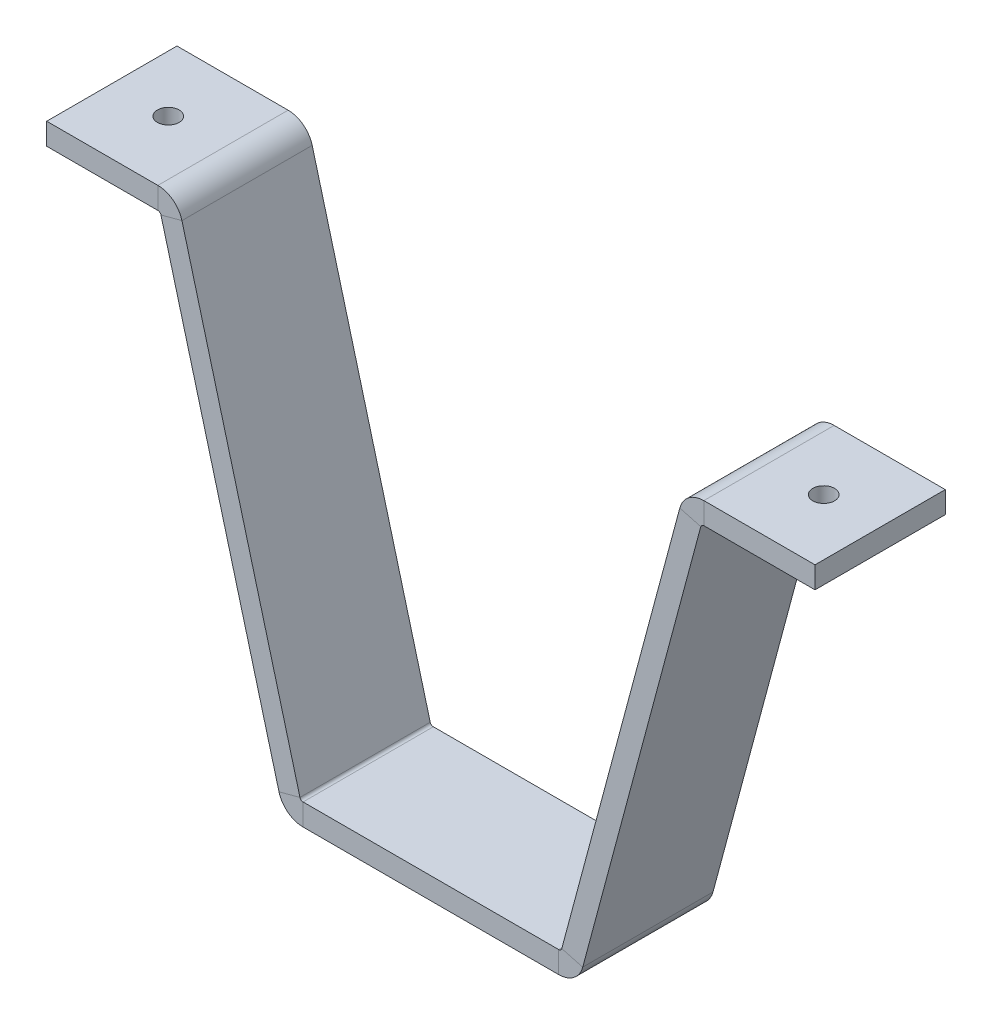
ISO-10303-21;
HEADER;
FILE_DESCRIPTION(('STEP AP214'),'2;1');
FILE_NAME('part.step','',(''),(''),'','','');
FILE_SCHEMA(('AUTOMOTIVE_DESIGN { 1 0 10303 214 1 1 1 1 }'));
ENDSEC;
DATA;
#1=APPLICATION_CONTEXT('core data for automotive mechanical design processes');
#2=APPLICATION_PROTOCOL_DEFINITION('international standard','automotive_design',2000,#1);
#3=PRODUCT_CONTEXT('',#1,'mechanical');
#4=PRODUCT('Part','Part','',(#3));
#5=PRODUCT_RELATED_PRODUCT_CATEGORY('part','',(#4));
#6=PRODUCT_DEFINITION_FORMATION('','',#4);
#7=PRODUCT_DEFINITION_CONTEXT('part definition',#1,'design');
#8=PRODUCT_DEFINITION('design','',#6,#7);
#9=PRODUCT_DEFINITION_SHAPE('','',#8);
#10=(LENGTH_UNIT() NAMED_UNIT(*) SI_UNIT(.MILLI.,.METRE.));
#11=(NAMED_UNIT(*) PLANE_ANGLE_UNIT() SI_UNIT($,.RADIAN.));
#12=(NAMED_UNIT(*) SI_UNIT($,.STERADIAN.) SOLID_ANGLE_UNIT());
#13=UNCERTAINTY_MEASURE_WITH_UNIT(LENGTH_MEASURE(1.E-05),#10,'distance_accuracy_value','');
#14=(GEOMETRIC_REPRESENTATION_CONTEXT(3) GLOBAL_UNCERTAINTY_ASSIGNED_CONTEXT((#13)) GLOBAL_UNIT_ASSIGNED_CONTEXT((#10,
#11,#12)) REPRESENTATION_CONTEXT('',''));
#15=CARTESIAN_POINT('',(0.,0.,0.));
#16=DIRECTION('',(0.,0.,1.));
#17=DIRECTION('',(1.,0.,0.));
#18=AXIS2_PLACEMENT_3D('',#15,#16,#17);
#19=CARTESIAN_POINT('',(62.3067299011725,106.251840891797,4.99999999999998));
#20=DIRECTION('',(0.,0.,1.));
#21=DIRECTION('',(1.,0.,0.));
#22=AXIS2_PLACEMENT_3D('',#19,#20,#21);
#23=PLANE('',#22);
#24=DIRECTION('',(0.258819045102525,0.965925826289067,0.));
#25=VECTOR('',#24,1.);
#26=CARTESIAN_POINT('',(62.3067299011725,106.251840891797,4.99999999999998));
#27=LINE('',#26,#25);
#28=CARTESIAN_POINT('',(34.9759170357446,4.25185866586486,5.));
#29=VERTEX_POINT('',#28);
#30=CARTESIAN_POINT('',(62.1604419968733,105.70588700042,4.99999999999998));
#31=VERTEX_POINT('',#30);
#32=EDGE_CURVE('E346',#29,#31,#27,.T.);
#33=ORIENTED_EDGE('',*,*,#32,.T.);
#34=DIRECTION('',(-0.965925826289065,0.258819045102533,0.));
#35=VECTOR('',#34,1.);
#36=CARTESIAN_POINT('',(62.1604419968733,105.70588700042,4.99999999999999));
#37=LINE('',#36,#35);
#38=CARTESIAN_POINT('',(57.3308128654279,106.999982225933,4.99999999999999));
#39=VERTEX_POINT('',#38);
#40=EDGE_CURVE('E227',#31,#39,#37,.T.);
#41=ORIENTED_EDGE('',*,*,#40,.T.);
#42=DIRECTION('',(0.258819045102525,0.965925826289067,0.));
#43=VECTOR('',#42,1.);
#44=CARTESIAN_POINT('',(57.4771007697272,107.54593611731,4.99999999999998));
#45=LINE('',#44,#43);
#46=CARTESIAN_POINT('',(30.1462879042992,5.54595389137748,5.));
#47=VERTEX_POINT('',#46);
#48=EDGE_CURVE('E345',#47,#39,#45,.T.);
#49=ORIENTED_EDGE('',*,*,#48,.F.);
#50=DIRECTION('',(0.965925826289067,-0.258819045102525,0.));
#51=VECTOR('',#50,1.);
#52=CARTESIAN_POINT('',(30.1462879042992,5.54595389137748,4.99999999999999));
#53=LINE('',#52,#51);
#54=EDGE_CURVE('E332',#47,#29,#53,.T.);
#55=ORIENTED_EDGE('',*,*,#54,.T.);
#56=EDGE_LOOP('',(#33,#41,#49,#55));
#57=FACE_BOUND('',#56,.T.);
#58=ADVANCED_FACE('F33',(#57),#23,.T.);
#59=CARTESIAN_POINT('',(34.8296291314453,3.70590477448738,-25.));
#60=DIRECTION('',(0.965925826289067,-0.258819045102525,0.));
#61=DIRECTION('',(0.258819045102525,0.965925826289067,0.));
#62=AXIS2_PLACEMENT_3D('',#59,#60,#61);
#63=PLANE('',#62);
#64=DIRECTION('',(-0.258819045102525,-0.965925826289067,0.));
#65=VECTOR('',#64,1.);
#66=CARTESIAN_POINT('',(34.8296291314453,3.70590477448738,-25.));
#67=LINE('',#66,#65);
#68=CARTESIAN_POINT('',(62.1604419968733,105.70588700042,-25.));
#69=VERTEX_POINT('',#68);
#70=CARTESIAN_POINT('',(34.9759170357446,4.25185866586486,-25.));
#71=VERTEX_POINT('',#70);
#72=EDGE_CURVE('E348',#69,#71,#67,.T.);
#73=ORIENTED_EDGE('',*,*,#72,.F.);
#74=DIRECTION('',(0.,0.,1.));
#75=VECTOR('',#74,1.);
#76=CARTESIAN_POINT('',(62.1604419968733,105.70588700042,4.99999999999998));
#77=LINE('',#76,#75);
#78=EDGE_CURVE('E57',#31,#69,#77,.F.);
#79=ORIENTED_EDGE('',*,*,#78,.F.);
#80=ORIENTED_EDGE('',*,*,#32,.F.);
#81=DIRECTION('',(0.,0.,-1.));
#82=VECTOR('',#81,1.);
#83=CARTESIAN_POINT('',(34.9759170357446,4.25185866586486,-25.));
#84=LINE('',#83,#82);
#85=EDGE_CURVE('E340',#29,#71,#84,.T.);
#86=ORIENTED_EDGE('',*,*,#85,.T.);
#87=EDGE_LOOP('',(#73,#79,#80,#86));
#88=FACE_BOUND('',#87,.T.);
#89=ADVANCED_FACE('F429',(#88),#63,.T.);
#90=CARTESIAN_POINT('',(30.,5.,-25.));
#91=DIRECTION('',(0.965925826289067,-0.258819045102525,0.));
#92=DIRECTION('',(0.258819045102525,0.965925826289067,0.));
#93=AXIS2_PLACEMENT_3D('',#90,#91,#92);
#94=PLANE('',#93);
#95=DIRECTION('',(0.,0.,1.));
#96=VECTOR('',#95,1.);
#97=CARTESIAN_POINT('',(57.3308128654279,106.999982225933,4.99999999999998));
#98=LINE('',#97,#96);
#99=CARTESIAN_POINT('',(57.3308128654279,106.999982225933,-25.));
#100=VERTEX_POINT('',#99);
#101=EDGE_CURVE('E181',#39,#100,#98,.F.);
#102=ORIENTED_EDGE('',*,*,#101,.T.);
#103=DIRECTION('',(-0.258819045102525,-0.965925826289067,0.));
#104=VECTOR('',#103,1.);
#105=CARTESIAN_POINT('',(30.,5.,-25.));
#106=LINE('',#105,#104);
#107=CARTESIAN_POINT('',(30.1462879042992,5.54595389137748,-25.));
#108=VERTEX_POINT('',#107);
#109=EDGE_CURVE('E349',#100,#108,#106,.T.);
#110=ORIENTED_EDGE('',*,*,#109,.T.);
#111=DIRECTION('',(0.,0.,-1.));
#112=VECTOR('',#111,1.);
#113=CARTESIAN_POINT('',(30.1462879042992,5.54595389137748,4.99999999999999));
#114=LINE('',#113,#112);
#115=EDGE_CURVE('E334',#47,#108,#114,.T.);
#116=ORIENTED_EDGE('',*,*,#115,.F.);
#117=ORIENTED_EDGE('',*,*,#48,.T.);
#118=EDGE_LOOP('',(#102,#110,#116,#117));
#119=FACE_BOUND('',#118,.T.);
#120=ADVANCED_FACE('F470',(#119),#94,.F.);
#121=CARTESIAN_POINT('',(-34.8296291314453,3.70590477448738,-25.));
#122=DIRECTION('',(0.,0.,-1.));
#123=DIRECTION('',(0.,1.,0.));
#124=AXIS2_PLACEMENT_3D('',#121,#122,#123);
#125=PLANE('',#124);
#126=DIRECTION('',(-0.258819045102525,0.965925826289067,0.));
#127=VECTOR('',#126,1.);
#128=CARTESIAN_POINT('',(-34.8296291314453,3.70590477448738,-25.));
#129=LINE('',#128,#127);
#130=CARTESIAN_POINT('',(-34.9759170357446,4.25185866586486,-25.));
#131=VERTEX_POINT('',#130);
#132=CARTESIAN_POINT('',(-62.1604419968733,105.70588700042,-25.));
#133=VERTEX_POINT('',#132);
#134=EDGE_CURVE('E302',#131,#133,#129,.T.);
#135=ORIENTED_EDGE('',*,*,#134,.T.);
#136=DIRECTION('',(0.965925826289068,0.25881904510252,0.));
#137=VECTOR('',#136,1.);
#138=CARTESIAN_POINT('',(-62.1604419968733,105.70588700042,-25.));
#139=LINE('',#138,#137);
#140=CARTESIAN_POINT('',(-57.3308128654279,106.999982225933,-25.));
#141=VERTEX_POINT('',#140);
#142=EDGE_CURVE('E275',#133,#141,#139,.T.);
#143=ORIENTED_EDGE('',*,*,#142,.T.);
#144=DIRECTION('',(-0.258819045102525,0.965925826289067,0.));
#145=VECTOR('',#144,1.);
#146=CARTESIAN_POINT('',(-30.,5.,-25.));
#147=LINE('',#146,#145);
#148=CARTESIAN_POINT('',(-30.1462879042992,5.54595389137748,-25.));
#149=VERTEX_POINT('',#148);
#150=EDGE_CURVE('E301',#149,#141,#147,.T.);
#151=ORIENTED_EDGE('',*,*,#150,.F.);
#152=DIRECTION('',(-0.965925826289067,-0.258819045102525,0.));
#153=VECTOR('',#152,1.);
#154=CARTESIAN_POINT('',(-30.1462879042992,5.54595389137748,-25.));
#155=LINE('',#154,#153);
#156=EDGE_CURVE('E288',#149,#131,#155,.T.);
#157=ORIENTED_EDGE('',*,*,#156,.T.);
#158=EDGE_LOOP('',(#135,#143,#151,#157));
#159=FACE_BOUND('',#158,.T.);
#160=ADVANCED_FACE('F404',(#159),#125,.T.);
#161=CARTESIAN_POINT('',(-62.3067299011725,106.251840891797,-25.));
#162=DIRECTION('',(0.965925826289067,0.258819045102525,0.));
#163=DIRECTION('',(-0.258819045102525,0.965925826289067,0.));
#164=AXIS2_PLACEMENT_3D('',#161,#162,#163);
#165=PLANE('',#164);
#166=DIRECTION('',(0.,0.,-1.));
#167=VECTOR('',#166,1.);
#168=CARTESIAN_POINT('',(-62.1604419968733,105.70588700042,-25.));
#169=LINE('',#168,#167);
#170=CARTESIAN_POINT('',(-62.1604419968733,105.70588700042,5.00000000000002));
#171=VERTEX_POINT('',#170);
#172=EDGE_CURVE('E281',#133,#171,#169,.F.);
#173=ORIENTED_EDGE('',*,*,#172,.F.);
#174=ORIENTED_EDGE('',*,*,#134,.F.);
#175=DIRECTION('',(0.,0.,-1.));
#176=VECTOR('',#175,1.);
#177=CARTESIAN_POINT('',(-34.9759170357446,4.25185866586486,-25.));
#178=LINE('',#177,#176);
#179=CARTESIAN_POINT('',(-34.9759170357446,4.25185866586486,5.00000000000001));
#180=VERTEX_POINT('',#179);
#181=EDGE_CURVE('E297',#180,#131,#178,.T.);
#182=ORIENTED_EDGE('',*,*,#181,.F.);
#183=DIRECTION('',(0.258819045102525,-0.965925826289067,0.));
#184=VECTOR('',#183,1.);
#185=CARTESIAN_POINT('',(-62.3067299011725,106.251840891797,5.00000000000002));
#186=LINE('',#185,#184);
#187=EDGE_CURVE('E305',#171,#180,#186,.T.);
#188=ORIENTED_EDGE('',*,*,#187,.F.);
#189=EDGE_LOOP('',(#173,#174,#182,#188));
#190=FACE_BOUND('',#189,.T.);
#191=ADVANCED_FACE('F402',(#190),#165,.F.);
#192=CARTESIAN_POINT('',(-57.4771007697272,107.54593611731,-25.));
#193=DIRECTION('',(0.965925826289067,0.258819045102525,0.));
#194=DIRECTION('',(-0.258819045102525,0.965925826289067,0.));
#195=AXIS2_PLACEMENT_3D('',#192,#193,#194);
#196=PLANE('',#195);
#197=ORIENTED_EDGE('',*,*,#150,.T.);
#198=DIRECTION('',(0.,0.,-1.));
#199=VECTOR('',#198,1.);
#200=CARTESIAN_POINT('',(-57.3308128654279,106.999982225933,-25.));
#201=LINE('',#200,#199);
#202=CARTESIAN_POINT('',(-57.3308128654279,106.999982225933,5.00000000000002));
#203=VERTEX_POINT('',#202);
#204=EDGE_CURVE('E268',#141,#203,#201,.F.);
#205=ORIENTED_EDGE('',*,*,#204,.T.);
#206=DIRECTION('',(0.258819045102525,-0.965925826289067,0.));
#207=VECTOR('',#206,1.);
#208=CARTESIAN_POINT('',(-57.4771007697272,107.54593611731,5.00000000000002));
#209=LINE('',#208,#207);
#210=CARTESIAN_POINT('',(-30.1462879042992,5.54595389137748,5.00000000000001));
#211=VERTEX_POINT('',#210);
#212=EDGE_CURVE('E306',#203,#211,#209,.T.);
#213=ORIENTED_EDGE('',*,*,#212,.T.);
#214=DIRECTION('',(0.,0.,1.));
#215=VECTOR('',#214,1.);
#216=CARTESIAN_POINT('',(-30.1462879042992,5.54595389137748,-25.));
#217=LINE('',#216,#215);
#218=EDGE_CURVE('E291',#149,#211,#217,.T.);
#219=ORIENTED_EDGE('',*,*,#218,.F.);
#220=EDGE_LOOP('',(#197,#205,#213,#219));
#221=FACE_BOUND('',#220,.T.);
#222=ADVANCED_FACE('F411',(#221),#196,.T.);
#223=CARTESIAN_POINT('',(-30.,5.,5.));
#224=DIRECTION('',(0.,0.,-1.));
#225=DIRECTION('',(-1.,0.,0.));
#226=AXIS2_PLACEMENT_3D('',#223,#224,#225);
#227=PLANE('',#226);
#228=DIRECTION('',(0.,-1.,0.));
#229=VECTOR('',#228,1.);
#230=CARTESIAN_POINT('',(-29.4347869406547,5.,5.00000000000001));
#231=LINE('',#230,#229);
#232=CARTESIAN_POINT('',(-29.4347869406547,5.,5.));
#233=VERTEX_POINT('',#232);
#234=CARTESIAN_POINT('',(-29.4347869406547,0.,5.00000000000001));
#235=VERTEX_POINT('',#234);
#236=EDGE_CURVE('E318',#233,#235,#231,.T.);
#237=ORIENTED_EDGE('',*,*,#236,.T.);
#238=DIRECTION('',(1.,0.,0.));
#239=VECTOR('',#238,1.);
#240=CARTESIAN_POINT('',(-30.,0.,5.));
#241=LINE('',#240,#239);
#242=CARTESIAN_POINT('',(29.4347869406547,0.,5.));
#243=VERTEX_POINT('',#242);
#244=EDGE_CURVE('E376',#235,#243,#241,.T.);
#245=ORIENTED_EDGE('',*,*,#244,.T.);
#246=DIRECTION('',(0.,-1.,0.));
#247=VECTOR('',#246,1.);
#248=CARTESIAN_POINT('',(29.4347869406547,4.99999999999999,5.));
#249=LINE('',#248,#247);
#250=CARTESIAN_POINT('',(29.4347869406547,5.,5.));
#251=VERTEX_POINT('',#250);
#252=EDGE_CURVE('E373',#251,#243,#249,.T.);
#253=ORIENTED_EDGE('',*,*,#252,.F.);
#254=DIRECTION('',(1.,0.,0.));
#255=VECTOR('',#254,1.);
#256=CARTESIAN_POINT('',(-30.,5.,5.));
#257=LINE('',#256,#255);
#258=EDGE_CURVE('E42',#233,#251,#257,.T.);
#259=ORIENTED_EDGE('',*,*,#258,.F.);
#260=EDGE_LOOP('',(#237,#245,#253,#259));
#261=FACE_BOUND('',#260,.T.);
#262=ADVANCED_FACE('F35',(#261),#227,.F.);
#263=CARTESIAN_POINT('',(-30.,5.,-25.));
#264=DIRECTION('',(0.,0.,1.));
#265=DIRECTION('',(1.,0.,0.));
#266=AXIS2_PLACEMENT_3D('',#263,#264,#265);
#267=PLANE('',#266);
#268=DIRECTION('',(0.,-1.,0.));
#269=VECTOR('',#268,1.);
#270=CARTESIAN_POINT('',(-29.4347869406547,5.,-25.));
#271=LINE('',#270,#269);
#272=CARTESIAN_POINT('',(-29.4347869406547,5.,-25.));
#273=VERTEX_POINT('',#272);
#274=CARTESIAN_POINT('',(-29.4347869406547,0.,-25.));
#275=VERTEX_POINT('',#274);
#276=EDGE_CURVE('E329',#273,#275,#271,.T.);
#277=ORIENTED_EDGE('',*,*,#276,.F.);
#278=DIRECTION('',(-1.,0.,0.));
#279=VECTOR('',#278,1.);
#280=CARTESIAN_POINT('',(-30.,5.,-25.));
#281=LINE('',#280,#279);
#282=CARTESIAN_POINT('',(29.4347869406547,5.,-25.));
#283=VERTEX_POINT('',#282);
#284=EDGE_CURVE('E11',#283,#273,#281,.T.);
#285=ORIENTED_EDGE('',*,*,#284,.F.);
#286=DIRECTION('',(0.,-1.,0.));
#287=VECTOR('',#286,1.);
#288=CARTESIAN_POINT('',(29.4347869406547,4.99999999999999,-25.));
#289=LINE('',#288,#287);
#290=CARTESIAN_POINT('',(29.4347869406547,0.,-25.));
#291=VERTEX_POINT('',#290);
#292=EDGE_CURVE('E362',#283,#291,#289,.T.);
#293=ORIENTED_EDGE('',*,*,#292,.T.);
#294=DIRECTION('',(-1.,0.,0.));
#295=VECTOR('',#294,1.);
#296=CARTESIAN_POINT('',(-30.,0.,-25.));
#297=LINE('',#296,#295);
#298=EDGE_CURVE('E37',#291,#275,#297,.T.);
#299=ORIENTED_EDGE('',*,*,#298,.T.);
#300=EDGE_LOOP('',(#277,#285,#293,#299));
#301=FACE_BOUND('',#300,.T.);
#302=ADVANCED_FACE('F384',(#301),#267,.F.);
#303=CARTESIAN_POINT('',(-30.,5.,5.));
#304=DIRECTION('',(0.,1.,0.));
#305=DIRECTION('',(0.,0.,1.));
#306=AXIS2_PLACEMENT_3D('',#303,#304,#305);
#307=PLANE('',#306);
#308=ORIENTED_EDGE('',*,*,#284,.T.);
#309=DIRECTION('',(0.,0.,1.));
#310=VECTOR('',#309,1.);
#311=CARTESIAN_POINT('',(-29.4347869406547,5.,5.00000000000001));
#312=LINE('',#311,#310);
#313=EDGE_CURVE('E324',#233,#273,#312,.F.);
#314=ORIENTED_EDGE('',*,*,#313,.F.);
#315=ORIENTED_EDGE('',*,*,#258,.T.);
#316=DIRECTION('',(0.,0.,-1.));
#317=VECTOR('',#316,1.);
#318=CARTESIAN_POINT('',(29.4347869406547,4.99999999999999,-25.));
#319=LINE('',#318,#317);
#320=EDGE_CURVE('E368',#283,#251,#319,.F.);
#321=ORIENTED_EDGE('',*,*,#320,.F.);
#322=EDGE_LOOP('',(#308,#314,#315,#321));
#323=FACE_BOUND('',#322,.T.);
#324=ADVANCED_FACE('F488',(#323),#307,.T.);
#325=CARTESIAN_POINT('',(-30.,0.,5.));
#326=DIRECTION('',(0.,1.,0.));
#327=DIRECTION('',(0.,0.,1.));
#328=AXIS2_PLACEMENT_3D('',#325,#326,#327);
#329=PLANE('',#328);
#330=DIRECTION('',(0.,0.,1.));
#331=VECTOR('',#330,1.);
#332=CARTESIAN_POINT('',(-29.4347869406547,0.,5.00000000000001));
#333=LINE('',#332,#331);
#334=EDGE_CURVE('E312',#235,#275,#333,.F.);
#335=ORIENTED_EDGE('',*,*,#334,.T.);
#336=ORIENTED_EDGE('',*,*,#298,.F.);
#337=DIRECTION('',(0.,0.,-1.));
#338=VECTOR('',#337,1.);
#339=CARTESIAN_POINT('',(29.4347869406547,0.,-25.));
#340=LINE('',#339,#338);
#341=EDGE_CURVE('E355',#291,#243,#340,.F.);
#342=ORIENTED_EDGE('',*,*,#341,.T.);
#343=ORIENTED_EDGE('',*,*,#244,.F.);
#344=EDGE_LOOP('',(#335,#336,#342,#343));
#345=FACE_BOUND('',#344,.T.);
#346=ADVANCED_FACE('F421',(#345),#329,.F.);
#347=CARTESIAN_POINT('',(29.4347869406547,5.7366,5.));
#348=DIRECTION('',(0.,0.,1.));
#349=DIRECTION('',(1.,0.,0.));
#350=AXIS2_PLACEMENT_3D('',#347,#348,#349);
#351=PLANE('',#350);
#352=ORIENTED_EDGE('',*,*,#54,.F.);
#353=CARTESIAN_POINT('',(29.4347869406547,5.7366,5.));
#354=DIRECTION('',(0.,0.,-1.));
#355=DIRECTION('',(-1.,0.,0.));
#356=AXIS2_PLACEMENT_3D('',#353,#354,#355);
#357=CIRCLE('',#356,0.736600000000002);
#358=EDGE_CURVE('E365',#251,#47,#357,.F.);
#359=ORIENTED_EDGE('',*,*,#358,.F.);
#360=ORIENTED_EDGE('',*,*,#252,.T.);
#361=CARTESIAN_POINT('',(29.4347869406547,5.7366,5.));
#362=DIRECTION('',(0.,0.,-1.));
#363=DIRECTION('',(-1.,0.,0.));
#364=AXIS2_PLACEMENT_3D('',#361,#362,#363);
#365=CIRCLE('',#364,5.7366);
#366=EDGE_CURVE('E358',#243,#29,#365,.F.);
#367=ORIENTED_EDGE('',*,*,#366,.T.);
#368=EDGE_LOOP('',(#352,#359,#360,#367));
#369=FACE_BOUND('',#368,.T.);
#370=ADVANCED_FACE('F427',(#369),#351,.T.);
#371=CARTESIAN_POINT('',(29.4347869406547,5.7366,-25.));
#372=DIRECTION('',(0.,0.,1.));
#373=DIRECTION('',(1.,0.,0.));
#374=AXIS2_PLACEMENT_3D('',#371,#372,#373);
#375=PLANE('',#374);
#376=CARTESIAN_POINT('',(29.4347869406547,5.7366,-25.));
#377=DIRECTION('',(0.,0.,-1.));
#378=DIRECTION('',(-1.,0.,0.));
#379=AXIS2_PLACEMENT_3D('',#376,#377,#378);
#380=CIRCLE('',#379,0.736600000000002);
#381=EDGE_CURVE('E351',#108,#283,#380,.T.);
#382=ORIENTED_EDGE('',*,*,#381,.F.);
#383=DIRECTION('',(0.965925826289067,-0.258819045102525,0.));
#384=VECTOR('',#383,1.);
#385=CARTESIAN_POINT('',(30.1462879042992,5.54595389137748,-25.));
#386=LINE('',#385,#384);
#387=EDGE_CURVE('E337',#108,#71,#386,.T.);
#388=ORIENTED_EDGE('',*,*,#387,.T.);
#389=CARTESIAN_POINT('',(29.4347869406547,5.7366,-25.));
#390=DIRECTION('',(0.,0.,-1.));
#391=DIRECTION('',(-1.,0.,0.));
#392=AXIS2_PLACEMENT_3D('',#389,#390,#391);
#393=CIRCLE('',#392,5.7366);
#394=EDGE_CURVE('E359',#71,#291,#393,.T.);
#395=ORIENTED_EDGE('',*,*,#394,.T.);
#396=ORIENTED_EDGE('',*,*,#292,.F.);
#397=EDGE_LOOP('',(#382,#388,#395,#396));
#398=FACE_BOUND('',#397,.T.);
#399=ADVANCED_FACE('F479',(#398),#375,.F.);
#400=CARTESIAN_POINT('',(29.4347869406547,5.7366,-25.));
#401=DIRECTION('',(0.,0.,-1.));
#402=DIRECTION('',(0.965925826289067,-0.258819045102525,0.));
#403=AXIS2_PLACEMENT_3D('',#400,#401,#402);
#404=CYLINDRICAL_SURFACE('',#403,5.7366);
#405=ORIENTED_EDGE('',*,*,#341,.F.);
#406=ORIENTED_EDGE('',*,*,#394,.F.);
#407=ORIENTED_EDGE('',*,*,#85,.F.);
#408=ORIENTED_EDGE('',*,*,#366,.F.);
#409=EDGE_LOOP('',(#405,#406,#407,#408));
#410=FACE_BOUND('',#409,.T.);
#411=ADVANCED_FACE('F428',(#410),#404,.T.);
#412=CARTESIAN_POINT('',(29.4347869406547,5.7366,-25.));
#413=DIRECTION('',(0.,0.,-1.));
#414=DIRECTION('',(0.965925826289067,-0.258819045102525,0.));
#415=AXIS2_PLACEMENT_3D('',#412,#413,#414);
#416=CYLINDRICAL_SURFACE('',#415,0.736600000000002);
#417=ORIENTED_EDGE('',*,*,#320,.T.);
#418=ORIENTED_EDGE('',*,*,#358,.T.);
#419=ORIENTED_EDGE('',*,*,#115,.T.);
#420=ORIENTED_EDGE('',*,*,#381,.T.);
#421=EDGE_LOOP('',(#417,#418,#419,#420));
#422=FACE_BOUND('',#421,.T.);
#423=ADVANCED_FACE('F478',(#422),#416,.F.);
#424=CARTESIAN_POINT('',(34.8296291314453,3.70590477448738,-25.));
#425=DIRECTION('',(0.,0.,-1.));
#426=DIRECTION('',(0.,1.,0.));
#427=AXIS2_PLACEMENT_3D('',#424,#425,#426);
#428=PLANE('',#427);
#429=DIRECTION('',(-0.965925826289065,0.258819045102533,0.));
#430=VECTOR('',#429,1.);
#431=CARTESIAN_POINT('',(62.1604419968733,105.70588700042,-25.));
#432=LINE('',#431,#430);
#433=EDGE_CURVE('E50',#69,#100,#432,.T.);
#434=ORIENTED_EDGE('',*,*,#433,.F.);
#435=ORIENTED_EDGE('',*,*,#72,.T.);
#436=ORIENTED_EDGE('',*,*,#387,.F.);
#437=ORIENTED_EDGE('',*,*,#109,.F.);
#438=EDGE_LOOP('',(#434,#435,#436,#437));
#439=FACE_BOUND('',#438,.T.);
#440=ADVANCED_FACE('F474',(#439),#428,.T.);
#441=CARTESIAN_POINT('',(-29.4347869406547,5.7366,-25.));
#442=DIRECTION('',(0.,0.,-1.));
#443=DIRECTION('',(-1.,0.,0.));
#444=AXIS2_PLACEMENT_3D('',#441,#442,#443);
#445=PLANE('',#444);
#446=ORIENTED_EDGE('',*,*,#156,.F.);
#447=CARTESIAN_POINT('',(-29.4347869406547,5.7366,-25.));
#448=DIRECTION('',(0.,0.,1.));
#449=DIRECTION('',(1.,0.,0.));
#450=AXIS2_PLACEMENT_3D('',#447,#448,#449);
#451=CIRCLE('',#450,0.736599999999999);
#452=EDGE_CURVE('E321',#273,#149,#451,.F.);
#453=ORIENTED_EDGE('',*,*,#452,.F.);
#454=ORIENTED_EDGE('',*,*,#276,.T.);
#455=CARTESIAN_POINT('',(-29.4347869406547,5.7366,-25.));
#456=DIRECTION('',(0.,0.,1.));
#457=DIRECTION('',(1.,0.,0.));
#458=AXIS2_PLACEMENT_3D('',#455,#456,#457);
#459=CIRCLE('',#458,5.7366);
#460=EDGE_CURVE('E314',#275,#131,#459,.F.);
#461=ORIENTED_EDGE('',*,*,#460,.T.);
#462=EDGE_LOOP('',(#446,#453,#454,#461));
#463=FACE_BOUND('',#462,.T.);
#464=ADVANCED_FACE('F392',(#463),#445,.T.);
#465=CARTESIAN_POINT('',(-29.4347869406547,5.7366,5.00000000000001));
#466=DIRECTION('',(0.,0.,-1.));
#467=DIRECTION('',(-1.,0.,0.));
#468=AXIS2_PLACEMENT_3D('',#465,#466,#467);
#469=PLANE('',#468);
#470=CARTESIAN_POINT('',(-29.4347869406547,5.7366,5.00000000000001));
#471=DIRECTION('',(0.,0.,1.));
#472=DIRECTION('',(1.,0.,0.));
#473=AXIS2_PLACEMENT_3D('',#470,#471,#472);
#474=CIRCLE('',#473,0.736599999999999);
#475=EDGE_CURVE('E308',#211,#233,#474,.T.);
#476=ORIENTED_EDGE('',*,*,#475,.F.);
#477=DIRECTION('',(-0.965925826289067,-0.258819045102525,0.));
#478=VECTOR('',#477,1.);
#479=CARTESIAN_POINT('',(-30.1462879042992,5.54595389137748,5.00000000000001));
#480=LINE('',#479,#478);
#481=EDGE_CURVE('E294',#211,#180,#480,.T.);
#482=ORIENTED_EDGE('',*,*,#481,.T.);
#483=CARTESIAN_POINT('',(-29.4347869406547,5.7366,5.00000000000001));
#484=DIRECTION('',(0.,0.,1.));
#485=DIRECTION('',(1.,0.,0.));
#486=AXIS2_PLACEMENT_3D('',#483,#484,#485);
#487=CIRCLE('',#486,5.7366);
#488=EDGE_CURVE('E315',#180,#235,#487,.T.);
#489=ORIENTED_EDGE('',*,*,#488,.T.);
#490=ORIENTED_EDGE('',*,*,#236,.F.);
#491=EDGE_LOOP('',(#476,#482,#489,#490));
#492=FACE_BOUND('',#491,.T.);
#493=ADVANCED_FACE('F418',(#492),#469,.F.);
#494=CARTESIAN_POINT('',(-29.4347869406547,5.7366,5.00000000000001));
#495=DIRECTION('',(0.,0.,1.));
#496=DIRECTION('',(-0.965925826289067,-0.258819045102525,0.));
#497=AXIS2_PLACEMENT_3D('',#494,#495,#496);
#498=CYLINDRICAL_SURFACE('',#497,5.7366);
#499=ORIENTED_EDGE('',*,*,#334,.F.);
#500=ORIENTED_EDGE('',*,*,#488,.F.);
#501=ORIENTED_EDGE('',*,*,#181,.T.);
#502=ORIENTED_EDGE('',*,*,#460,.F.);
#503=EDGE_LOOP('',(#499,#500,#501,#502));
#504=FACE_BOUND('',#503,.T.);
#505=ADVANCED_FACE('F395',(#504),#498,.T.);
#506=CARTESIAN_POINT('',(-29.4347869406547,5.7366,5.00000000000001));
#507=DIRECTION('',(0.,0.,1.));
#508=DIRECTION('',(-0.965925826289067,-0.258819045102525,0.));
#509=AXIS2_PLACEMENT_3D('',#506,#507,#508);
#510=CYLINDRICAL_SURFACE('',#509,0.736599999999999);
#511=ORIENTED_EDGE('',*,*,#313,.T.);
#512=ORIENTED_EDGE('',*,*,#452,.T.);
#513=ORIENTED_EDGE('',*,*,#218,.T.);
#514=ORIENTED_EDGE('',*,*,#475,.T.);
#515=EDGE_LOOP('',(#511,#512,#513,#514));
#516=FACE_BOUND('',#515,.T.);
#517=ADVANCED_FACE('F408',(#516),#510,.F.);
#518=CARTESIAN_POINT('',(-62.3067299011725,106.251840891797,5.00000000000002));
#519=DIRECTION('',(0.,0.,1.));
#520=DIRECTION('',(1.,0.,0.));
#521=AXIS2_PLACEMENT_3D('',#518,#519,#520);
#522=PLANE('',#521);
#523=DIRECTION('',(0.965925826289068,0.25881904510252,0.));
#524=VECTOR('',#523,1.);
#525=CARTESIAN_POINT('',(-62.1604419968733,105.70588700042,5.00000000000002));
#526=LINE('',#525,#524);
#527=EDGE_CURVE('E285',#171,#203,#526,.T.);
#528=ORIENTED_EDGE('',*,*,#527,.F.);
#529=ORIENTED_EDGE('',*,*,#187,.T.);
#530=ORIENTED_EDGE('',*,*,#481,.F.);
#531=ORIENTED_EDGE('',*,*,#212,.F.);
#532=EDGE_LOOP('',(#528,#529,#530,#531));
#533=FACE_BOUND('',#532,.T.);
#534=ADVANCED_FACE('F416',(#533),#522,.T.);
#535=CARTESIAN_POINT('',(-62.8719429605178,105.515240891797,5.00000000000002));
#536=DIRECTION('',(0.,0.,1.));
#537=DIRECTION('',(1.,0.,0.));
#538=AXIS2_PLACEMENT_3D('',#535,#536,#537);
#539=PLANE('',#538);
#540=DIRECTION('',(0.,1.,0.));
#541=VECTOR('',#540,1.);
#542=CARTESIAN_POINT('',(-62.8719429605178,106.251840891797,5.00000000000002));
#543=LINE('',#542,#541);
#544=CARTESIAN_POINT('',(-62.8719429605178,106.251840891797,5.00000000000002));
#545=VERTEX_POINT('',#544);
#546=CARTESIAN_POINT('',(-62.8719429605178,111.251840891797,5.00000000000002));
#547=VERTEX_POINT('',#546);
#548=EDGE_CURVE('E234',#545,#547,#543,.T.);
#549=ORIENTED_EDGE('',*,*,#548,.F.);
#550=CARTESIAN_POINT('',(-62.8719429605178,105.515240891797,5.00000000000002));
#551=DIRECTION('',(0.,0.,-1.));
#552=DIRECTION('',(-1.,0.,0.));
#553=AXIS2_PLACEMENT_3D('',#550,#551,#552);
#554=CIRCLE('',#553,0.736600000000004);
#555=EDGE_CURVE('E278',#171,#545,#554,.F.);
#556=ORIENTED_EDGE('',*,*,#555,.F.);
#557=ORIENTED_EDGE('',*,*,#527,.T.);
#558=CARTESIAN_POINT('',(-62.8719429605178,105.515240891797,5.00000000000002));
#559=DIRECTION('',(0.,0.,-1.));
#560=DIRECTION('',(-1.,0.,0.));
#561=AXIS2_PLACEMENT_3D('',#558,#559,#560);
#562=CIRCLE('',#561,5.7366);
#563=EDGE_CURVE('E271',#203,#547,#562,.F.);
#564=ORIENTED_EDGE('',*,*,#563,.T.);
#565=EDGE_LOOP('',(#549,#556,#557,#564));
#566=FACE_BOUND('',#565,.T.);
#567=ADVANCED_FACE('F509',(#566),#539,.T.);
#568=CARTESIAN_POINT('',(-62.8719429605178,105.515240891797,-25.));
#569=DIRECTION('',(0.,0.,1.));
#570=DIRECTION('',(1.,0.,0.));
#571=AXIS2_PLACEMENT_3D('',#568,#569,#570);
#572=PLANE('',#571);
#573=CARTESIAN_POINT('',(-62.8719429605178,105.515240891797,-25.));
#574=DIRECTION('',(0.,0.,-1.));
#575=DIRECTION('',(-1.,0.,0.));
#576=AXIS2_PLACEMENT_3D('',#573,#574,#575);
#577=CIRCLE('',#576,0.736600000000004);
#578=CARTESIAN_POINT('',(-62.8719429605178,106.251840891797,-25.));
#579=VERTEX_POINT('',#578);
#580=EDGE_CURVE('E265',#579,#133,#577,.T.);
#581=ORIENTED_EDGE('',*,*,#580,.F.);
#582=DIRECTION('',(0.,1.,0.));
#583=VECTOR('',#582,1.);
#584=CARTESIAN_POINT('',(-62.8719429605178,106.251840891797,-25.));
#585=LINE('',#584,#583);
#586=CARTESIAN_POINT('',(-62.8719429605178,111.251840891797,-25.));
#587=VERTEX_POINT('',#586);
#588=EDGE_CURVE('E238',#579,#587,#585,.T.);
#589=ORIENTED_EDGE('',*,*,#588,.T.);
#590=CARTESIAN_POINT('',(-62.8719429605178,105.515240891797,-25.));
#591=DIRECTION('',(0.,0.,-1.));
#592=DIRECTION('',(-1.,0.,0.));
#593=AXIS2_PLACEMENT_3D('',#590,#591,#592);
#594=CIRCLE('',#593,5.7366);
#595=EDGE_CURVE('E272',#587,#141,#594,.T.);
#596=ORIENTED_EDGE('',*,*,#595,.T.);
#597=ORIENTED_EDGE('',*,*,#142,.F.);
#598=EDGE_LOOP('',(#581,#589,#596,#597));
#599=FACE_BOUND('',#598,.T.);
#600=ADVANCED_FACE('F625',(#599),#572,.F.);
#601=CARTESIAN_POINT('',(-62.8719429605178,105.515240891797,-25.));
#602=DIRECTION('',(0.,0.,-1.));
#603=DIRECTION('',(0.,1.,0.));
#604=AXIS2_PLACEMENT_3D('',#601,#602,#603);
#605=CYLINDRICAL_SURFACE('',#604,5.7366);
#606=ORIENTED_EDGE('',*,*,#204,.F.);
#607=ORIENTED_EDGE('',*,*,#595,.F.);
#608=DIRECTION('',(0.,0.,-1.));
#609=VECTOR('',#608,1.);
#610=CARTESIAN_POINT('',(-62.8719429605178,111.251840891797,-25.));
#611=LINE('',#610,#609);
#612=EDGE_CURVE('E241',#547,#587,#611,.T.);
#613=ORIENTED_EDGE('',*,*,#612,.F.);
#614=ORIENTED_EDGE('',*,*,#563,.F.);
#615=EDGE_LOOP('',(#606,#607,#613,#614));
#616=FACE_BOUND('',#615,.T.);
#617=ADVANCED_FACE('F628',(#616),#605,.T.);
#618=CARTESIAN_POINT('',(-62.8719429605178,105.515240891797,-25.));
#619=DIRECTION('',(0.,0.,-1.));
#620=DIRECTION('',(0.,1.,0.));
#621=AXIS2_PLACEMENT_3D('',#618,#619,#620);
#622=CYLINDRICAL_SURFACE('',#621,0.736600000000004);
#623=ORIENTED_EDGE('',*,*,#172,.T.);
#624=ORIENTED_EDGE('',*,*,#555,.T.);
#625=DIRECTION('',(0.,0.,-1.));
#626=VECTOR('',#625,1.);
#627=CARTESIAN_POINT('',(-62.8719429605178,106.251840891797,5.00000000000002));
#628=LINE('',#627,#626);
#629=EDGE_CURVE('E236',#545,#579,#628,.T.);
#630=ORIENTED_EDGE('',*,*,#629,.T.);
#631=ORIENTED_EDGE('',*,*,#580,.T.);
#632=EDGE_LOOP('',(#623,#624,#630,#631));
#633=FACE_BOUND('',#632,.T.);
#634=ADVANCED_FACE('F631',(#633),#622,.F.);
#635=CARTESIAN_POINT('',(-62.3067299011725,111.251840891797,-25.));
#636=DIRECTION('',(0.,0.,-1.));
#637=DIRECTION('',(-1.,0.,0.));
#638=AXIS2_PLACEMENT_3D('',#635,#636,#637);
#639=PLANE('',#638);
#640=DIRECTION('',(1.,0.,0.));
#641=VECTOR('',#640,1.);
#642=CARTESIAN_POINT('',(-62.3067299011725,111.251840891797,-25.));
#643=LINE('',#642,#641);
#644=CARTESIAN_POINT('',(-88.4700949612777,111.251840891797,-25.));
#645=VERTEX_POINT('',#644);
#646=EDGE_CURVE('E253',#645,#587,#643,.T.);
#647=ORIENTED_EDGE('',*,*,#646,.T.);
#648=ORIENTED_EDGE('',*,*,#588,.F.);
#649=DIRECTION('',(1.,0.,0.));
#650=VECTOR('',#649,1.);
#651=CARTESIAN_POINT('',(-62.3067299011725,106.251840891797,-25.));
#652=LINE('',#651,#650);
#653=CARTESIAN_POINT('',(-88.4700949612777,106.251840891797,-25.));
#654=VERTEX_POINT('',#653);
#655=EDGE_CURVE('E250',#654,#579,#652,.T.);
#656=ORIENTED_EDGE('',*,*,#655,.F.);
#657=DIRECTION('',(0.,-1.,0.));
#658=VECTOR('',#657,1.);
#659=CARTESIAN_POINT('',(-88.4700949612777,111.251840891797,-25.));
#660=LINE('',#659,#658);
#661=EDGE_CURVE('E263',#645,#654,#660,.T.);
#662=ORIENTED_EDGE('',*,*,#661,.F.);
#663=EDGE_LOOP('',(#647,#648,#656,#662));
#664=FACE_BOUND('',#663,.T.);
#665=ADVANCED_FACE('F622',(#664),#639,.T.);
#666=CARTESIAN_POINT('',(-88.4700949612777,111.251840891797,5.00000000000003));
#667=DIRECTION('',(0.,0.,1.));
#668=DIRECTION('',(1.,0.,0.));
#669=AXIS2_PLACEMENT_3D('',#666,#667,#668);
#670=PLANE('',#669);
#671=DIRECTION('',(-1.,0.,0.));
#672=VECTOR('',#671,1.);
#673=CARTESIAN_POINT('',(-88.4700949612777,106.251840891797,5.00000000000003));
#674=LINE('',#673,#672);
#675=CARTESIAN_POINT('',(-88.4700949612777,106.251840891797,5.00000000000003));
#676=VERTEX_POINT('',#675);
#677=EDGE_CURVE('E246',#545,#676,#674,.T.);
#678=ORIENTED_EDGE('',*,*,#677,.F.);
#679=ORIENTED_EDGE('',*,*,#548,.T.);
#680=DIRECTION('',(-1.,0.,0.));
#681=VECTOR('',#680,1.);
#682=CARTESIAN_POINT('',(-88.4700949612777,111.251840891797,5.00000000000003));
#683=LINE('',#682,#681);
#684=CARTESIAN_POINT('',(-88.4700949612777,111.251840891797,5.00000000000003));
#685=VERTEX_POINT('',#684);
#686=EDGE_CURVE('E247',#547,#685,#683,.T.);
#687=ORIENTED_EDGE('',*,*,#686,.T.);
#688=DIRECTION('',(0.,-1.,0.));
#689=VECTOR('',#688,1.);
#690=CARTESIAN_POINT('',(-88.4700949612777,111.251840891797,5.00000000000003));
#691=LINE('',#690,#689);
#692=EDGE_CURVE('E256',#685,#676,#691,.T.);
#693=ORIENTED_EDGE('',*,*,#692,.T.);
#694=EDGE_LOOP('',(#678,#679,#687,#693));
#695=FACE_BOUND('',#694,.T.);
#696=ADVANCED_FACE('F616',(#695),#670,.T.);
#697=CARTESIAN_POINT('',(-62.3067299011725,111.251840891797,-25.));
#698=DIRECTION('',(0.,1.,0.));
#699=DIRECTION('',(0.,0.,1.));
#700=AXIS2_PLACEMENT_3D('',#697,#698,#699);
#701=PLANE('',#700);
#702=CARTESIAN_POINT('',(-75.4700949612777,111.251840891797,-9.99999999999998));
#703=DIRECTION('',(0.,1.,0.));
#704=DIRECTION('',(0.,0.,1.));
#705=AXIS2_PLACEMENT_3D('',#702,#703,#704);
#706=CIRCLE('',#705,2.49999999999999);
#707=CARTESIAN_POINT('',(-75.4700949612777,111.251840891797,-7.5));
#708=VERTEX_POINT('',#707);
#709=EDGE_CURVE('E594',#708,#708,#706,.T.);
#710=ORIENTED_EDGE('',*,*,#709,.F.);
#711=EDGE_LOOP('',(#710));
#712=FACE_BOUND('',#711,.T.);
#713=ORIENTED_EDGE('',*,*,#686,.F.);
#714=ORIENTED_EDGE('',*,*,#612,.T.);
#715=ORIENTED_EDGE('',*,*,#646,.F.);
#716=DIRECTION('',(0.,0.,-1.));
#717=VECTOR('',#716,1.);
#718=CARTESIAN_POINT('',(-88.4700949612777,111.251840891797,-25.));
#719=LINE('',#718,#717);
#720=EDGE_CURVE('E249',#685,#645,#719,.T.);
#721=ORIENTED_EDGE('',*,*,#720,.F.);
#722=EDGE_LOOP('',(#713,#714,#715,#721));
#723=FACE_BOUND('',#722,.T.);
#724=ADVANCED_FACE('F607',(#712,#723),#701,.T.);
#725=CARTESIAN_POINT('',(-62.3067299011725,106.251840891797,-25.));
#726=DIRECTION('',(0.,1.,0.));
#727=DIRECTION('',(0.,0.,1.));
#728=AXIS2_PLACEMENT_3D('',#725,#726,#727);
#729=PLANE('',#728);
#730=CARTESIAN_POINT('',(-75.4700949612777,106.251840891797,-9.99999999999998));
#731=DIRECTION('',(0.,-1.,0.));
#732=DIRECTION('',(0.,0.,-1.));
#733=AXIS2_PLACEMENT_3D('',#730,#731,#732);
#734=CIRCLE('',#733,2.49999999999999);
#735=CARTESIAN_POINT('',(-75.4700949612777,106.251840891797,-12.5));
#736=VERTEX_POINT('',#735);
#737=EDGE_CURVE('E597',#736,#736,#734,.T.);
#738=ORIENTED_EDGE('',*,*,#737,.F.);
#739=EDGE_LOOP('',(#738));
#740=FACE_BOUND('',#739,.T.);
#741=ORIENTED_EDGE('',*,*,#629,.F.);
#742=ORIENTED_EDGE('',*,*,#677,.T.);
#743=DIRECTION('',(0.,0.,-1.));
#744=VECTOR('',#743,1.);
#745=CARTESIAN_POINT('',(-88.4700949612777,106.251840891797,-25.));
#746=LINE('',#745,#744);
#747=EDGE_CURVE('E258',#676,#654,#746,.T.);
#748=ORIENTED_EDGE('',*,*,#747,.T.);
#749=ORIENTED_EDGE('',*,*,#655,.T.);
#750=EDGE_LOOP('',(#741,#742,#748,#749));
#751=FACE_BOUND('',#750,.T.);
#752=ADVANCED_FACE('F535',(#740,#751),#729,.F.);
#753=CARTESIAN_POINT('',(-88.4700949612777,111.251840891797,-25.));
#754=DIRECTION('',(-1.,0.,0.));
#755=DIRECTION('',(0.,0.,1.));
#756=AXIS2_PLACEMENT_3D('',#753,#754,#755);
#757=PLANE('',#756);
#758=ORIENTED_EDGE('',*,*,#747,.F.);
#759=ORIENTED_EDGE('',*,*,#692,.F.);
#760=ORIENTED_EDGE('',*,*,#720,.T.);
#761=ORIENTED_EDGE('',*,*,#661,.T.);
#762=EDGE_LOOP('',(#758,#759,#760,#761));
#763=FACE_BOUND('',#762,.T.);
#764=ADVANCED_FACE('F528',(#763),#757,.T.);
#765=CARTESIAN_POINT('',(62.8719429605178,105.515240891797,-25.));
#766=DIRECTION('',(0.,0.,-1.));
#767=DIRECTION('',(-1.,0.,0.));
#768=AXIS2_PLACEMENT_3D('',#765,#766,#767);
#769=PLANE('',#768);
#770=DIRECTION('',(0.,1.,0.));
#771=VECTOR('',#770,1.);
#772=CARTESIAN_POINT('',(62.8719429605178,106.251840891797,-25.));
#773=LINE('',#772,#771);
#774=CARTESIAN_POINT('',(62.8719429605178,106.251840891797,-25.));
#775=VERTEX_POINT('',#774);
#776=CARTESIAN_POINT('',(62.8719429605178,111.251840891797,-25.));
#777=VERTEX_POINT('',#776);
#778=EDGE_CURVE('E438',#775,#777,#773,.T.);
#779=ORIENTED_EDGE('',*,*,#778,.F.);
#780=CARTESIAN_POINT('',(62.8719429605178,105.515240891797,-25.));
#781=DIRECTION('',(0.,0.,1.));
#782=DIRECTION('',(1.,0.,0.));
#783=AXIS2_PLACEMENT_3D('',#780,#781,#782);
#784=CIRCLE('',#783,0.736600000000018);
#785=EDGE_CURVE('E184',#69,#775,#784,.F.);
#786=ORIENTED_EDGE('',*,*,#785,.F.);
#787=ORIENTED_EDGE('',*,*,#433,.T.);
#788=CARTESIAN_POINT('',(62.8719429605178,105.515240891797,-25.));
#789=DIRECTION('',(0.,0.,1.));
#790=DIRECTION('',(1.,0.,0.));
#791=AXIS2_PLACEMENT_3D('',#788,#789,#790);
#792=CIRCLE('',#791,5.73660000000002);
#793=EDGE_CURVE('E226',#100,#777,#792,.F.);
#794=ORIENTED_EDGE('',*,*,#793,.T.);
#795=EDGE_LOOP('',(#779,#786,#787,#794));
#796=FACE_BOUND('',#795,.T.);
#797=ADVANCED_FACE('F526',(#796),#769,.T.);
#798=CARTESIAN_POINT('',(62.8719429605178,105.515240891797,4.99999999999999));
#799=DIRECTION('',(0.,0.,-1.));
#800=DIRECTION('',(-1.,0.,0.));
#801=AXIS2_PLACEMENT_3D('',#798,#799,#800);
#802=PLANE('',#801);
#803=CARTESIAN_POINT('',(62.8719429605178,105.515240891797,4.99999999999999));
#804=DIRECTION('',(0.,0.,1.));
#805=DIRECTION('',(1.,0.,0.));
#806=AXIS2_PLACEMENT_3D('',#803,#804,#805);
#807=CIRCLE('',#806,0.736600000000018);
#808=CARTESIAN_POINT('',(62.8719429605178,106.251840891797,4.99999999999999));
#809=VERTEX_POINT('',#808);
#810=EDGE_CURVE('E191',#809,#31,#807,.T.);
#811=ORIENTED_EDGE('',*,*,#810,.F.);
#812=DIRECTION('',(0.,1.,0.));
#813=VECTOR('',#812,1.);
#814=CARTESIAN_POINT('',(62.8719429605178,106.251840891797,4.99999999999999));
#815=LINE('',#814,#813);
#816=CARTESIAN_POINT('',(62.8719429605178,111.251840891797,4.99999999999999));
#817=VERTEX_POINT('',#816);
#818=EDGE_CURVE('E188',#809,#817,#815,.T.);
#819=ORIENTED_EDGE('',*,*,#818,.T.);
#820=CARTESIAN_POINT('',(62.8719429605178,105.515240891797,4.99999999999999));
#821=DIRECTION('',(0.,0.,1.));
#822=DIRECTION('',(1.,0.,0.));
#823=AXIS2_PLACEMENT_3D('',#820,#821,#822);
#824=CIRCLE('',#823,5.73660000000002);
#825=EDGE_CURVE('E174',#817,#39,#824,.T.);
#826=ORIENTED_EDGE('',*,*,#825,.T.);
#827=ORIENTED_EDGE('',*,*,#40,.F.);
#828=EDGE_LOOP('',(#811,#819,#826,#827));
#829=FACE_BOUND('',#828,.T.);
#830=ADVANCED_FACE('F189',(#829),#802,.F.);
#831=CARTESIAN_POINT('',(62.8719429605178,105.515240891797,4.99999999999998));
#832=DIRECTION('',(0.,0.,1.));
#833=DIRECTION('',(0.,1.,0.));
#834=AXIS2_PLACEMENT_3D('',#831,#832,#833);
#835=CYLINDRICAL_SURFACE('',#834,5.73660000000002);
#836=ORIENTED_EDGE('',*,*,#101,.F.);
#837=ORIENTED_EDGE('',*,*,#825,.F.);
#838=DIRECTION('',(0.,0.,-1.));
#839=VECTOR('',#838,1.);
#840=CARTESIAN_POINT('',(62.8719429605178,111.251840891797,-25.));
#841=LINE('',#840,#839);
#842=EDGE_CURVE('E179',#817,#777,#841,.T.);
#843=ORIENTED_EDGE('',*,*,#842,.T.);
#844=ORIENTED_EDGE('',*,*,#793,.F.);
#845=EDGE_LOOP('',(#836,#837,#843,#844));
#846=FACE_BOUND('',#845,.T.);
#847=ADVANCED_FACE('F176',(#846),#835,.T.);
#848=CARTESIAN_POINT('',(62.8719429605178,105.515240891797,4.99999999999998));
#849=DIRECTION('',(0.,0.,1.));
#850=DIRECTION('',(0.,1.,0.));
#851=AXIS2_PLACEMENT_3D('',#848,#849,#850);
#852=CYLINDRICAL_SURFACE('',#851,0.736600000000018);
#853=ORIENTED_EDGE('',*,*,#78,.T.);
#854=ORIENTED_EDGE('',*,*,#785,.T.);
#855=DIRECTION('',(0.,0.,1.));
#856=VECTOR('',#855,1.);
#857=CARTESIAN_POINT('',(62.8719429605178,106.251840891797,-25.));
#858=LINE('',#857,#856);
#859=EDGE_CURVE('E196',#775,#809,#858,.T.);
#860=ORIENTED_EDGE('',*,*,#859,.T.);
#861=ORIENTED_EDGE('',*,*,#810,.T.);
#862=EDGE_LOOP('',(#853,#854,#860,#861));
#863=FACE_BOUND('',#862,.T.);
#864=ADVANCED_FACE('F433',(#863),#852,.F.);
#865=CARTESIAN_POINT('',(62.3067299011725,111.251840891797,-25.));
#866=DIRECTION('',(0.,0.,-1.));
#867=DIRECTION('',(-1.,0.,0.));
#868=AXIS2_PLACEMENT_3D('',#865,#866,#867);
#869=PLANE('',#868);
#870=DIRECTION('',(1.,0.,0.));
#871=VECTOR('',#870,1.);
#872=CARTESIAN_POINT('',(62.3067299011725,106.251840891797,-25.));
#873=LINE('',#872,#871);
#874=CARTESIAN_POINT('',(88.4700949612777,106.251840891797,-25.0000000000001));
#875=VERTEX_POINT('',#874);
#876=EDGE_CURVE('E206',#775,#875,#873,.T.);
#877=ORIENTED_EDGE('',*,*,#876,.F.);
#878=ORIENTED_EDGE('',*,*,#778,.T.);
#879=DIRECTION('',(1.,0.,0.));
#880=VECTOR('',#879,1.);
#881=CARTESIAN_POINT('',(62.3067299011725,111.251840891797,-25.));
#882=LINE('',#881,#880);
#883=CARTESIAN_POINT('',(88.4700949612777,111.251840891797,-25.0000000000001));
#884=VERTEX_POINT('',#883);
#885=EDGE_CURVE('E205',#777,#884,#882,.T.);
#886=ORIENTED_EDGE('',*,*,#885,.T.);
#887=DIRECTION('',(0.,-1.,0.));
#888=VECTOR('',#887,1.);
#889=CARTESIAN_POINT('',(88.4700949612777,111.251840891797,-25.0000000000001));
#890=LINE('',#889,#888);
#891=EDGE_CURVE('E210',#884,#875,#890,.T.);
#892=ORIENTED_EDGE('',*,*,#891,.T.);
#893=EDGE_LOOP('',(#877,#878,#886,#892));
#894=FACE_BOUND('',#893,.T.);
#895=ADVANCED_FACE('F447',(#894),#869,.T.);
#896=CARTESIAN_POINT('',(88.4700949612777,111.251840891797,5.00000000000002));
#897=DIRECTION('',(0.,0.,1.));
#898=DIRECTION('',(1.,0.,0.));
#899=AXIS2_PLACEMENT_3D('',#896,#897,#898);
#900=PLANE('',#899);
#901=DIRECTION('',(-1.,0.,0.));
#902=VECTOR('',#901,1.);
#903=CARTESIAN_POINT('',(88.4700949612777,111.251840891797,5.00000000000002));
#904=LINE('',#903,#902);
#905=CARTESIAN_POINT('',(88.4700949612777,111.251840891797,5.00000000000002));
#906=VERTEX_POINT('',#905);
#907=EDGE_CURVE('E203',#906,#817,#904,.T.);
#908=ORIENTED_EDGE('',*,*,#907,.T.);
#909=ORIENTED_EDGE('',*,*,#818,.F.);
#910=DIRECTION('',(-1.,0.,0.));
#911=VECTOR('',#910,1.);
#912=CARTESIAN_POINT('',(88.4700949612777,106.251840891797,5.00000000000002));
#913=LINE('',#912,#911);
#914=CARTESIAN_POINT('',(88.4700949612777,106.251840891797,5.00000000000002));
#915=VERTEX_POINT('',#914);
#916=EDGE_CURVE('E222',#915,#809,#913,.T.);
#917=ORIENTED_EDGE('',*,*,#916,.F.);
#918=DIRECTION('',(0.,-1.,0.));
#919=VECTOR('',#918,1.);
#920=CARTESIAN_POINT('',(88.4700949612777,111.251840891797,5.00000000000002));
#921=LINE('',#920,#919);
#922=EDGE_CURVE('E209',#906,#915,#921,.T.);
#923=ORIENTED_EDGE('',*,*,#922,.F.);
#924=EDGE_LOOP('',(#908,#909,#917,#923));
#925=FACE_BOUND('',#924,.T.);
#926=ADVANCED_FACE('F208',(#925),#900,.T.);
#927=CARTESIAN_POINT('',(88.4700949612777,111.251840891797,-25.0000000000001));
#928=DIRECTION('',(0.,-1.,0.));
#929=DIRECTION('',(0.,0.,-1.));
#930=AXIS2_PLACEMENT_3D('',#927,#928,#929);
#931=PLANE('',#930);
#932=CARTESIAN_POINT('',(75.4700949612777,111.251840891797,-9.99999999999998));
#933=DIRECTION('',(0.,-1.,0.));
#934=DIRECTION('',(0.,0.,-1.));
#935=AXIS2_PLACEMENT_3D('',#932,#933,#934);
#936=CIRCLE('',#935,2.49999999999999);
#937=CARTESIAN_POINT('',(75.4700949612777,111.251840891797,-12.5));
#938=VERTEX_POINT('',#937);
#939=EDGE_CURVE('E441',#938,#938,#936,.T.);
#940=ORIENTED_EDGE('',*,*,#939,.T.);
#941=EDGE_LOOP('',(#940));
#942=FACE_BOUND('',#941,.T.);
#943=ORIENTED_EDGE('',*,*,#842,.F.);
#944=ORIENTED_EDGE('',*,*,#907,.F.);
#945=DIRECTION('',(0.,0.,1.));
#946=VECTOR('',#945,1.);
#947=CARTESIAN_POINT('',(88.4700949612777,111.251840891797,-25.0000000000001));
#948=LINE('',#947,#946);
#949=EDGE_CURVE('E211',#884,#906,#948,.T.);
#950=ORIENTED_EDGE('',*,*,#949,.F.);
#951=ORIENTED_EDGE('',*,*,#885,.F.);
#952=EDGE_LOOP('',(#943,#944,#950,#951));
#953=FACE_BOUND('',#952,.T.);
#954=ADVANCED_FACE('F201',(#942,#953),#931,.F.);
#955=CARTESIAN_POINT('',(88.4700949612777,106.251840891797,-25.0000000000001));
#956=DIRECTION('',(0.,-1.,0.));
#957=DIRECTION('',(0.,0.,-1.));
#958=AXIS2_PLACEMENT_3D('',#955,#956,#957);
#959=PLANE('',#958);
#960=CARTESIAN_POINT('',(75.4700949612777,106.251840891797,-9.99999999999998));
#961=DIRECTION('',(0.,-1.,0.));
#962=DIRECTION('',(0.,0.,-1.));
#963=AXIS2_PLACEMENT_3D('',#960,#961,#962);
#964=CIRCLE('',#963,2.49999999999999);
#965=CARTESIAN_POINT('',(75.4700949612777,106.251840891797,-12.5));
#966=VERTEX_POINT('',#965);
#967=EDGE_CURVE('E600',#966,#966,#964,.T.);
#968=ORIENTED_EDGE('',*,*,#967,.F.);
#969=EDGE_LOOP('',(#968));
#970=FACE_BOUND('',#969,.T.);
#971=ORIENTED_EDGE('',*,*,#916,.T.);
#972=ORIENTED_EDGE('',*,*,#859,.F.);
#973=ORIENTED_EDGE('',*,*,#876,.T.);
#974=DIRECTION('',(0.,0.,1.));
#975=VECTOR('',#974,1.);
#976=CARTESIAN_POINT('',(88.4700949612777,106.251840891797,-25.0000000000001));
#977=LINE('',#976,#975);
#978=EDGE_CURVE('E219',#875,#915,#977,.T.);
#979=ORIENTED_EDGE('',*,*,#978,.T.);
#980=EDGE_LOOP('',(#971,#972,#973,#979));
#981=FACE_BOUND('',#980,.T.);
#982=ADVANCED_FACE('F451',(#970,#981),#959,.T.);
#983=CARTESIAN_POINT('',(88.4700949612777,111.251840891797,-25.0000000000001));
#984=DIRECTION('',(1.,0.,0.));
#985=DIRECTION('',(0.,0.,-1.));
#986=AXIS2_PLACEMENT_3D('',#983,#984,#985);
#987=PLANE('',#986);
#988=ORIENTED_EDGE('',*,*,#978,.F.);
#989=ORIENTED_EDGE('',*,*,#891,.F.);
#990=ORIENTED_EDGE('',*,*,#949,.T.);
#991=ORIENTED_EDGE('',*,*,#922,.T.);
#992=EDGE_LOOP('',(#988,#989,#990,#991));
#993=FACE_BOUND('',#992,.T.);
#994=ADVANCED_FACE('F450',(#993),#987,.T.);
#995=CARTESIAN_POINT('',(75.4700949612777,106.251840891797,-9.99999999999998));
#996=DIRECTION('',(0.,-1.,0.));
#997=DIRECTION('',(0.,0.,-1.));
#998=AXIS2_PLACEMENT_3D('',#995,#996,#997);
#999=CYLINDRICAL_SURFACE('',#998,2.49999999999999);
#1000=ORIENTED_EDGE('',*,*,#967,.T.);
#1001=EDGE_LOOP('',(#1000));
#1002=FACE_BOUND('',#1001,.T.);
#1003=ORIENTED_EDGE('',*,*,#939,.F.);
#1004=EDGE_LOOP('',(#1003));
#1005=FACE_BOUND('',#1004,.T.);
#1006=ADVANCED_FACE('F459',(#1002,#1005),#999,.F.);
#1007=CARTESIAN_POINT('',(-75.4700949612777,106.251840891797,-9.99999999999998));
#1008=DIRECTION('',(0.,-1.,0.));
#1009=DIRECTION('',(0.,0.,-1.));
#1010=AXIS2_PLACEMENT_3D('',#1007,#1008,#1009);
#1011=CYLINDRICAL_SURFACE('',#1010,2.49999999999999);
#1012=ORIENTED_EDGE('',*,*,#709,.T.);
#1013=EDGE_LOOP('',(#1012));
#1014=FACE_BOUND('',#1013,.T.);
#1015=ORIENTED_EDGE('',*,*,#737,.T.);
#1016=EDGE_LOOP('',(#1015));
#1017=FACE_BOUND('',#1016,.T.);
#1018=ADVANCED_FACE('F577',(#1014,#1017),#1011,.F.);
#1019=CLOSED_SHELL('',(#58,#89,#120,#160,#191,#222,#262,#302,#324,#346,#370,#399,#411,#423,#440,
#464,#493,#505,#517,#534,#567,#600,#617,#634,#665,#696,#724,#752,#764,#797,#830,#847,#864,#895,
#926,#954,#982,#994,#1006,#1018));
#1020=MANIFOLD_SOLID_BREP('B2',#1019);
#1021=ADVANCED_BREP_SHAPE_REPRESENTATION('',(#18,#1020),#14);
#1022=SHAPE_DEFINITION_REPRESENTATION(#9,#1021);
ENDSEC;
END-ISO-10303-21;
